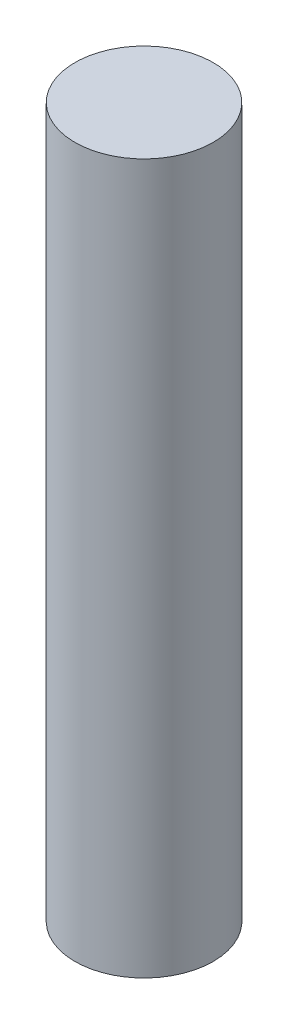
ISO-10303-21;
HEADER;
FILE_DESCRIPTION(('STEP AP214'),'2;1');
FILE_NAME('part.step','',(''),(''),'','','');
FILE_SCHEMA(('AUTOMOTIVE_DESIGN { 1 0 10303 214 1 1 1 1 }'));
ENDSEC;
DATA;
#1=APPLICATION_CONTEXT('core data for automotive mechanical design processes');
#2=APPLICATION_PROTOCOL_DEFINITION('international standard','automotive_design',2000,#1);
#3=PRODUCT_CONTEXT('',#1,'mechanical');
#4=PRODUCT('Part','Part','',(#3));
#5=PRODUCT_RELATED_PRODUCT_CATEGORY('part','',(#4));
#6=PRODUCT_DEFINITION_FORMATION('','',#4);
#7=PRODUCT_DEFINITION_CONTEXT('part definition',#1,'design');
#8=PRODUCT_DEFINITION('design','',#6,#7);
#9=PRODUCT_DEFINITION_SHAPE('','',#8);
#10=(LENGTH_UNIT() NAMED_UNIT(*) SI_UNIT(.MILLI.,.METRE.));
#11=(NAMED_UNIT(*) PLANE_ANGLE_UNIT() SI_UNIT($,.RADIAN.));
#12=(NAMED_UNIT(*) SI_UNIT($,.STERADIAN.) SOLID_ANGLE_UNIT());
#13=UNCERTAINTY_MEASURE_WITH_UNIT(LENGTH_MEASURE(1.E-05),#10,'distance_accuracy_value','');
#14=(GEOMETRIC_REPRESENTATION_CONTEXT(3) GLOBAL_UNCERTAINTY_ASSIGNED_CONTEXT((#13)) GLOBAL_UNIT_ASSIGNED_CONTEXT((#10,
#11,#12)) REPRESENTATION_CONTEXT('',''));
#15=CARTESIAN_POINT('',(0.,0.,0.));
#16=DIRECTION('',(0.,0.,1.));
#17=DIRECTION('',(1.,0.,0.));
#18=AXIS2_PLACEMENT_3D('',#15,#16,#17);
#19=CARTESIAN_POINT('',(11.2583377682132,-20.,14.3129255347827));
#20=DIRECTION('',(0.,1.,0.));
#21=DIRECTION('',(0.,0.,1.));
#22=AXIS2_PLACEMENT_3D('',#19,#20,#21);
#23=CYLINDRICAL_SURFACE('',#22,1.95);
#24=CARTESIAN_POINT('',(11.2583377682132,-20.,14.3129255347827));
#25=DIRECTION('',(0.,1.,0.));
#26=DIRECTION('',(1.,0.,0.));
#27=AXIS2_PLACEMENT_3D('',#24,#25,#26);
#28=CIRCLE('',#27,1.95);
#29=CARTESIAN_POINT('',(13.2083377682132,-20.,14.3129255347827));
#30=VERTEX_POINT('',#29);
#31=EDGE_CURVE('E8',#30,#30,#28,.T.);
#32=ORIENTED_EDGE('',*,*,#31,.T.);
#33=EDGE_LOOP('',(#32));
#34=FACE_BOUND('',#33,.T.);
#35=CARTESIAN_POINT('',(11.2583377682132,0.,14.3129255347827));
#36=DIRECTION('',(0.,1.,0.));
#37=DIRECTION('',(1.,0.,0.));
#38=AXIS2_PLACEMENT_3D('',#35,#36,#37);
#39=CIRCLE('',#38,1.95);
#40=CARTESIAN_POINT('',(13.2083377682132,0.,14.3129255347827));
#41=VERTEX_POINT('',#40);
#42=EDGE_CURVE('E16',#41,#41,#39,.T.);
#43=ORIENTED_EDGE('',*,*,#42,.F.);
#44=EDGE_LOOP('',(#43));
#45=FACE_BOUND('',#44,.T.);
#46=ADVANCED_FACE('F13',(#34,#45),#23,.T.);
#47=CARTESIAN_POINT('',(11.2583377682132,-20.,14.3129255347827));
#48=DIRECTION('',(0.,1.,0.));
#49=DIRECTION('',(0.,0.,1.));
#50=AXIS2_PLACEMENT_3D('',#47,#48,#49);
#51=PLANE('',#50);
#52=ORIENTED_EDGE('',*,*,#31,.F.);
#53=EDGE_LOOP('',(#52));
#54=FACE_BOUND('',#53,.T.);
#55=ADVANCED_FACE('F31',(#54),#51,.F.);
#56=CARTESIAN_POINT('',(11.2583377682132,0.,14.3129255347827));
#57=DIRECTION('',(0.,1.,0.));
#58=DIRECTION('',(0.,0.,1.));
#59=AXIS2_PLACEMENT_3D('',#56,#57,#58);
#60=PLANE('',#59);
#61=ORIENTED_EDGE('',*,*,#42,.T.);
#62=EDGE_LOOP('',(#61));
#63=FACE_BOUND('',#62,.T.);
#64=ADVANCED_FACE('F28',(#63),#60,.T.);
#65=CLOSED_SHELL('',(#46,#55,#64));
#66=MANIFOLD_SOLID_BREP('B1',#65);
#67=ADVANCED_BREP_SHAPE_REPRESENTATION('',(#18,#66),#14);
#68=SHAPE_DEFINITION_REPRESENTATION(#9,#67);
ENDSEC;
END-ISO-10303-21;
